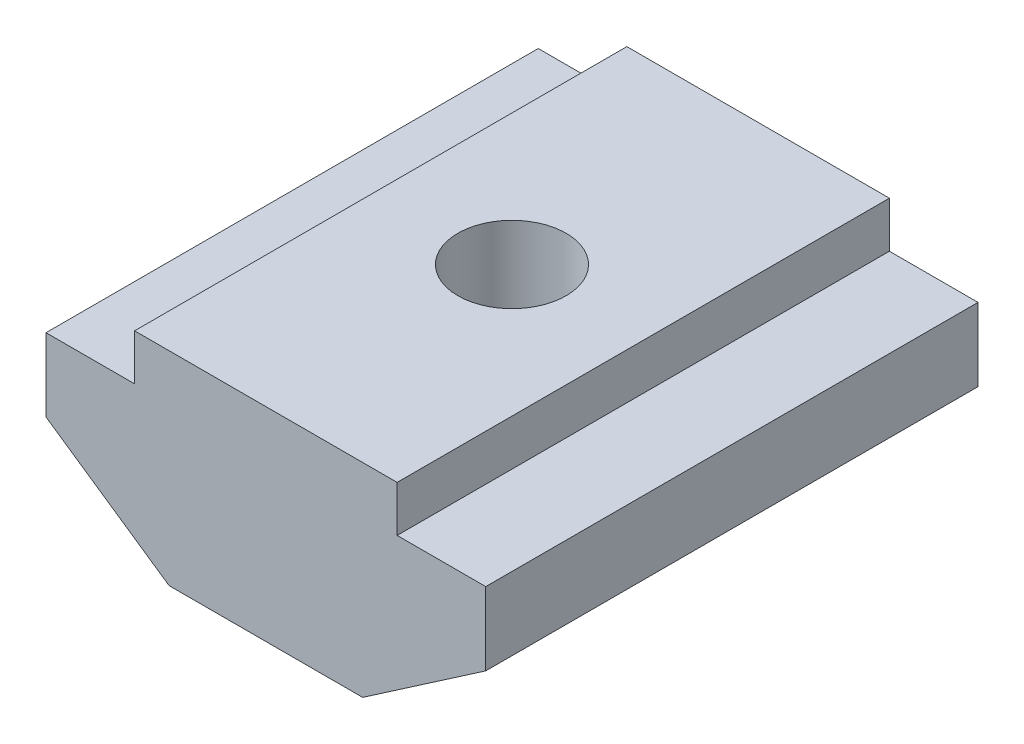
ISO-10303-21;
HEADER;
FILE_DESCRIPTION(('STEP AP214'),'2;1');
FILE_NAME('part.step','',(''),(''),'','','');
FILE_SCHEMA(('AUTOMOTIVE_DESIGN { 1 0 10303 214 1 1 1 1 }'));
ENDSEC;
DATA;
#1=APPLICATION_CONTEXT('core data for automotive mechanical design processes');
#2=APPLICATION_PROTOCOL_DEFINITION('international standard','automotive_design',2000,#1);
#3=PRODUCT_CONTEXT('',#1,'mechanical');
#4=PRODUCT('Part','Part','',(#3));
#5=PRODUCT_RELATED_PRODUCT_CATEGORY('part','',(#4));
#6=PRODUCT_DEFINITION_FORMATION('','',#4);
#7=PRODUCT_DEFINITION_CONTEXT('part definition',#1,'design');
#8=PRODUCT_DEFINITION('design','',#6,#7);
#9=PRODUCT_DEFINITION_SHAPE('','',#8);
#10=(LENGTH_UNIT() NAMED_UNIT(*) SI_UNIT(.MILLI.,.METRE.));
#11=(NAMED_UNIT(*) PLANE_ANGLE_UNIT() SI_UNIT($,.RADIAN.));
#12=(NAMED_UNIT(*) SI_UNIT($,.STERADIAN.) SOLID_ANGLE_UNIT());
#13=UNCERTAINTY_MEASURE_WITH_UNIT(LENGTH_MEASURE(1.E-05),#10,'distance_accuracy_value','');
#14=(GEOMETRIC_REPRESENTATION_CONTEXT(3) GLOBAL_UNCERTAINTY_ASSIGNED_CONTEXT((#13)) GLOBAL_UNIT_ASSIGNED_CONTEXT((#10,
#11,#12)) REPRESENTATION_CONTEXT('',''));
#15=CARTESIAN_POINT('',(0.,0.,0.));
#16=DIRECTION('',(0.,0.,1.));
#17=DIRECTION('',(1.,0.,0.));
#18=AXIS2_PLACEMENT_3D('',#15,#16,#17);
#19=CARTESIAN_POINT('',(-4.,0.,7.5));
#20=DIRECTION('',(1.,0.,0.));
#21=DIRECTION('',(0.,0.,-1.));
#22=AXIS2_PLACEMENT_3D('',#19,#20,#21);
#23=PLANE('',#22);
#24=DIRECTION('',(0.,-1.,0.));
#25=VECTOR('',#24,1.);
#26=CARTESIAN_POINT('',(-4.,0.,-7.5));
#27=LINE('',#26,#25);
#28=CARTESIAN_POINT('',(-4.,0.,-7.5));
#29=VERTEX_POINT('',#28);
#30=CARTESIAN_POINT('',(-4.,-1.4,-7.5));
#31=VERTEX_POINT('',#30);
#32=EDGE_CURVE('E147',#29,#31,#27,.T.);
#33=ORIENTED_EDGE('',*,*,#32,.T.);
#34=DIRECTION('',(0.,0.,-1.));
#35=VECTOR('',#34,1.);
#36=CARTESIAN_POINT('',(-4.,-1.4,7.5));
#37=LINE('',#36,#35);
#38=CARTESIAN_POINT('',(-4.,-1.4,7.5));
#39=VERTEX_POINT('',#38);
#40=EDGE_CURVE('E11',#39,#31,#37,.T.);
#41=ORIENTED_EDGE('',*,*,#40,.F.);
#42=DIRECTION('',(0.,-1.,0.));
#43=VECTOR('',#42,1.);
#44=CARTESIAN_POINT('',(-4.,0.,7.5));
#45=LINE('',#44,#43);
#46=CARTESIAN_POINT('',(-4.,0.,7.5));
#47=VERTEX_POINT('',#46);
#48=EDGE_CURVE('E166',#47,#39,#45,.T.);
#49=ORIENTED_EDGE('',*,*,#48,.F.);
#50=DIRECTION('',(0.,0.,-1.));
#51=VECTOR('',#50,1.);
#52=CARTESIAN_POINT('',(-4.,0.,7.5));
#53=LINE('',#52,#51);
#54=EDGE_CURVE('E143',#47,#29,#53,.T.);
#55=ORIENTED_EDGE('',*,*,#54,.T.);
#56=EDGE_LOOP('',(#33,#41,#49,#55));
#57=FACE_BOUND('',#56,.T.);
#58=ADVANCED_FACE('F39',(#57),#23,.F.);
#59=CARTESIAN_POINT('',(-4.,-1.4,7.5));
#60=DIRECTION('',(0.,-1.,0.));
#61=DIRECTION('',(1.,0.,0.));
#62=AXIS2_PLACEMENT_3D('',#59,#60,#61);
#63=PLANE('',#62);
#64=DIRECTION('',(-1.,0.,0.));
#65=VECTOR('',#64,1.);
#66=CARTESIAN_POINT('',(-4.,-1.4,-7.5));
#67=LINE('',#66,#65);
#68=CARTESIAN_POINT('',(-6.7,-1.4,-7.5));
#69=VERTEX_POINT('',#68);
#70=EDGE_CURVE('E150',#31,#69,#67,.T.);
#71=ORIENTED_EDGE('',*,*,#70,.T.);
#72=DIRECTION('',(0.,0.,-1.));
#73=VECTOR('',#72,1.);
#74=CARTESIAN_POINT('',(-6.7,-1.4,7.5));
#75=LINE('',#74,#73);
#76=CARTESIAN_POINT('',(-6.7,-1.4,7.5));
#77=VERTEX_POINT('',#76);
#78=EDGE_CURVE('E47',#77,#69,#75,.T.);
#79=ORIENTED_EDGE('',*,*,#78,.F.);
#80=DIRECTION('',(-1.,0.,0.));
#81=VECTOR('',#80,1.);
#82=CARTESIAN_POINT('',(-4.,-1.4,7.5));
#83=LINE('',#82,#81);
#84=EDGE_CURVE('E104',#39,#77,#83,.T.);
#85=ORIENTED_EDGE('',*,*,#84,.F.);
#86=ORIENTED_EDGE('',*,*,#40,.T.);
#87=EDGE_LOOP('',(#71,#79,#85,#86));
#88=FACE_BOUND('',#87,.T.);
#89=ADVANCED_FACE('F232',(#88),#63,.F.);
#90=CARTESIAN_POINT('',(-6.7,-1.4,7.5));
#91=DIRECTION('',(1.,0.,0.));
#92=DIRECTION('',(0.,0.,-1.));
#93=AXIS2_PLACEMENT_3D('',#90,#91,#92);
#94=PLANE('',#93);
#95=DIRECTION('',(0.,-1.,0.));
#96=VECTOR('',#95,1.);
#97=CARTESIAN_POINT('',(-6.7,-1.4,-7.5));
#98=LINE('',#97,#96);
#99=CARTESIAN_POINT('',(-6.7,-3.62515365738725,-7.5));
#100=VERTEX_POINT('',#99);
#101=EDGE_CURVE('E153',#69,#100,#98,.T.);
#102=ORIENTED_EDGE('',*,*,#101,.T.);
#103=DIRECTION('',(0.,0.,-1.));
#104=VECTOR('',#103,1.);
#105=CARTESIAN_POINT('',(-6.7,-3.62515365738725,7.5));
#106=LINE('',#105,#104);
#107=CARTESIAN_POINT('',(-6.7,-3.62515365738725,7.5));
#108=VERTEX_POINT('',#107);
#109=EDGE_CURVE('E179',#108,#100,#106,.T.);
#110=ORIENTED_EDGE('',*,*,#109,.F.);
#111=DIRECTION('',(0.,-1.,0.));
#112=VECTOR('',#111,1.);
#113=CARTESIAN_POINT('',(-6.7,-1.4,7.5));
#114=LINE('',#113,#112);
#115=EDGE_CURVE('E187',#77,#108,#114,.T.);
#116=ORIENTED_EDGE('',*,*,#115,.F.);
#117=ORIENTED_EDGE('',*,*,#78,.T.);
#118=EDGE_LOOP('',(#102,#110,#116,#117));
#119=FACE_BOUND('',#118,.T.);
#120=ADVANCED_FACE('F185',(#119),#94,.F.);
#121=CARTESIAN_POINT('',(-6.7,-3.62515365738725,7.5));
#122=DIRECTION('',(0.565895598532683,0.824476907839957,0.));
#123=DIRECTION('',(-0.824476907839957,0.565895598532683,0.));
#124=AXIS2_PLACEMENT_3D('',#121,#122,#123);
#125=PLANE('',#124);
#126=DIRECTION('',(0.824476907839957,-0.565895598532683,0.));
#127=VECTOR('',#126,1.);
#128=CARTESIAN_POINT('',(-6.7,-3.62515365738725,-7.5));
#129=LINE('',#128,#127);
#130=CARTESIAN_POINT('',(-2.94859893551943,-6.2,-7.5));
#131=VERTEX_POINT('',#130);
#132=EDGE_CURVE('E155',#100,#131,#129,.T.);
#133=ORIENTED_EDGE('',*,*,#132,.T.);
#134=DIRECTION('',(0.,0.,-1.));
#135=VECTOR('',#134,1.);
#136=CARTESIAN_POINT('',(-2.94859893551943,-6.2,7.5));
#137=LINE('',#136,#135);
#138=CARTESIAN_POINT('',(-2.94859893551943,-6.2,7.5));
#139=VERTEX_POINT('',#138);
#140=EDGE_CURVE('E176',#139,#131,#137,.T.);
#141=ORIENTED_EDGE('',*,*,#140,.F.);
#142=DIRECTION('',(0.824476907839957,-0.565895598532683,0.));
#143=VECTOR('',#142,1.);
#144=CARTESIAN_POINT('',(-6.7,-3.62515365738725,7.5));
#145=LINE('',#144,#143);
#146=EDGE_CURVE('E205',#108,#139,#145,.T.);
#147=ORIENTED_EDGE('',*,*,#146,.F.);
#148=ORIENTED_EDGE('',*,*,#109,.T.);
#149=EDGE_LOOP('',(#133,#141,#147,#148));
#150=FACE_BOUND('',#149,.T.);
#151=ADVANCED_FACE('F196',(#150),#125,.F.);
#152=CARTESIAN_POINT('',(-2.94859893551943,-6.2,7.5));
#153=DIRECTION('',(0.,1.,0.));
#154=DIRECTION('',(-1.,0.,0.));
#155=AXIS2_PLACEMENT_3D('',#152,#153,#154);
#156=PLANE('',#155);
#157=CARTESIAN_POINT('',(0.,-6.2,0.));
#158=DIRECTION('',(0.,1.,0.));
#159=DIRECTION('',(0.,0.,1.));
#160=AXIS2_PLACEMENT_3D('',#157,#158,#159);
#161=CIRCLE('',#160,1.65);
#162=CARTESIAN_POINT('',(0.,-6.2,1.65));
#163=VERTEX_POINT('',#162);
#164=EDGE_CURVE('E151',#163,#163,#161,.T.);
#165=ORIENTED_EDGE('',*,*,#164,.T.);
#166=EDGE_LOOP('',(#165));
#167=FACE_BOUND('',#166,.T.);
#168=DIRECTION('',(1.,0.,0.));
#169=VECTOR('',#168,1.);
#170=CARTESIAN_POINT('',(-2.94859893551943,-6.2,-7.5));
#171=LINE('',#170,#169);
#172=CARTESIAN_POINT('',(2.94859893551943,-6.2,-7.5));
#173=VERTEX_POINT('',#172);
#174=EDGE_CURVE('E157',#131,#173,#171,.T.);
#175=ORIENTED_EDGE('',*,*,#174,.T.);
#176=DIRECTION('',(0.,0.,-1.));
#177=VECTOR('',#176,1.);
#178=CARTESIAN_POINT('',(2.94859893551943,-6.2,7.5));
#179=LINE('',#178,#177);
#180=CARTESIAN_POINT('',(2.94859893551943,-6.2,7.5));
#181=VERTEX_POINT('',#180);
#182=EDGE_CURVE('E173',#181,#173,#179,.T.);
#183=ORIENTED_EDGE('',*,*,#182,.F.);
#184=DIRECTION('',(1.,0.,0.));
#185=VECTOR('',#184,1.);
#186=CARTESIAN_POINT('',(-2.94859893551943,-6.2,7.5));
#187=LINE('',#186,#185);
#188=EDGE_CURVE('E202',#139,#181,#187,.T.);
#189=ORIENTED_EDGE('',*,*,#188,.F.);
#190=ORIENTED_EDGE('',*,*,#140,.T.);
#191=EDGE_LOOP('',(#175,#183,#189,#190));
#192=FACE_BOUND('',#191,.T.);
#193=ADVANCED_FACE('F200',(#167,#192),#156,.F.);
#194=CARTESIAN_POINT('',(6.7,-3.62515365738725,7.5));
#195=DIRECTION('',(-0.565895598532683,0.824476907839957,0.));
#196=DIRECTION('',(-0.824476907839957,-0.565895598532683,0.));
#197=AXIS2_PLACEMENT_3D('',#194,#195,#196);
#198=PLANE('',#197);
#199=DIRECTION('',(0.824476907839957,0.565895598532683,0.));
#200=VECTOR('',#199,1.);
#201=CARTESIAN_POINT('',(6.7,-3.62515365738725,-7.5));
#202=LINE('',#201,#200);
#203=CARTESIAN_POINT('',(6.7,-3.62515365738725,-7.5));
#204=VERTEX_POINT('',#203);
#205=EDGE_CURVE('E159',#173,#204,#202,.T.);
#206=ORIENTED_EDGE('',*,*,#205,.T.);
#207=DIRECTION('',(0.,0.,-1.));
#208=VECTOR('',#207,1.);
#209=CARTESIAN_POINT('',(6.7,-3.62515365738725,7.5));
#210=LINE('',#209,#208);
#211=CARTESIAN_POINT('',(6.7,-3.62515365738725,7.5));
#212=VERTEX_POINT('',#211);
#213=EDGE_CURVE('E170',#212,#204,#210,.T.);
#214=ORIENTED_EDGE('',*,*,#213,.F.);
#215=DIRECTION('',(0.824476907839957,0.565895598532683,0.));
#216=VECTOR('',#215,1.);
#217=CARTESIAN_POINT('',(6.7,-3.62515365738725,7.5));
#218=LINE('',#217,#216);
#219=EDGE_CURVE('E204',#181,#212,#218,.T.);
#220=ORIENTED_EDGE('',*,*,#219,.F.);
#221=ORIENTED_EDGE('',*,*,#182,.T.);
#222=EDGE_LOOP('',(#206,#214,#220,#221));
#223=FACE_BOUND('',#222,.T.);
#224=ADVANCED_FACE('F244',(#223),#198,.F.);
#225=CARTESIAN_POINT('',(6.7,-1.4,7.5));
#226=DIRECTION('',(-1.,0.,0.));
#227=DIRECTION('',(0.,0.,1.));
#228=AXIS2_PLACEMENT_3D('',#225,#226,#227);
#229=PLANE('',#228);
#230=DIRECTION('',(0.,1.,0.));
#231=VECTOR('',#230,1.);
#232=CARTESIAN_POINT('',(6.7,-1.4,-7.5));
#233=LINE('',#232,#231);
#234=CARTESIAN_POINT('',(6.7,-1.4,-7.5));
#235=VERTEX_POINT('',#234);
#236=EDGE_CURVE('E161',#204,#235,#233,.T.);
#237=ORIENTED_EDGE('',*,*,#236,.T.);
#238=DIRECTION('',(0.,0.,-1.));
#239=VECTOR('',#238,1.);
#240=CARTESIAN_POINT('',(6.7,-1.4,7.5));
#241=LINE('',#240,#239);
#242=CARTESIAN_POINT('',(6.7,-1.4,7.5));
#243=VERTEX_POINT('',#242);
#244=EDGE_CURVE('E138',#243,#235,#241,.T.);
#245=ORIENTED_EDGE('',*,*,#244,.F.);
#246=DIRECTION('',(0.,1.,0.));
#247=VECTOR('',#246,1.);
#248=CARTESIAN_POINT('',(6.7,-1.4,7.5));
#249=LINE('',#248,#247);
#250=EDGE_CURVE('E129',#212,#243,#249,.T.);
#251=ORIENTED_EDGE('',*,*,#250,.F.);
#252=ORIENTED_EDGE('',*,*,#213,.T.);
#253=EDGE_LOOP('',(#237,#245,#251,#252));
#254=FACE_BOUND('',#253,.T.);
#255=ADVANCED_FACE('F241',(#254),#229,.F.);
#256=CARTESIAN_POINT('',(4.,-1.4,7.5));
#257=DIRECTION('',(0.,-1.,0.));
#258=DIRECTION('',(1.,0.,0.));
#259=AXIS2_PLACEMENT_3D('',#256,#257,#258);
#260=PLANE('',#259);
#261=DIRECTION('',(-1.,0.,0.));
#262=VECTOR('',#261,1.);
#263=CARTESIAN_POINT('',(4.,-1.4,-7.5));
#264=LINE('',#263,#262);
#265=CARTESIAN_POINT('',(4.,-1.4,-7.5));
#266=VERTEX_POINT('',#265);
#267=EDGE_CURVE('E137',#235,#266,#264,.T.);
#268=ORIENTED_EDGE('',*,*,#267,.T.);
#269=DIRECTION('',(0.,0.,-1.));
#270=VECTOR('',#269,1.);
#271=CARTESIAN_POINT('',(4.,-1.4,7.5));
#272=LINE('',#271,#270);
#273=CARTESIAN_POINT('',(4.,-1.4,7.5));
#274=VERTEX_POINT('',#273);
#275=EDGE_CURVE('E134',#274,#266,#272,.T.);
#276=ORIENTED_EDGE('',*,*,#275,.F.);
#277=DIRECTION('',(-1.,0.,0.));
#278=VECTOR('',#277,1.);
#279=CARTESIAN_POINT('',(4.,-1.4,7.5));
#280=LINE('',#279,#278);
#281=EDGE_CURVE('E123',#243,#274,#280,.T.);
#282=ORIENTED_EDGE('',*,*,#281,.F.);
#283=ORIENTED_EDGE('',*,*,#244,.T.);
#284=EDGE_LOOP('',(#268,#276,#282,#283));
#285=FACE_BOUND('',#284,.T.);
#286=ADVANCED_FACE('F135',(#285),#260,.F.);
#287=CARTESIAN_POINT('',(4.,0.,7.5));
#288=DIRECTION('',(-1.,0.,0.));
#289=DIRECTION('',(0.,0.,1.));
#290=AXIS2_PLACEMENT_3D('',#287,#288,#289);
#291=PLANE('',#290);
#292=DIRECTION('',(0.,1.,0.));
#293=VECTOR('',#292,1.);
#294=CARTESIAN_POINT('',(4.,0.,-7.5));
#295=LINE('',#294,#293);
#296=CARTESIAN_POINT('',(4.,0.,-7.5));
#297=VERTEX_POINT('',#296);
#298=EDGE_CURVE('E90',#266,#297,#295,.T.);
#299=ORIENTED_EDGE('',*,*,#298,.T.);
#300=DIRECTION('',(0.,0.,-1.));
#301=VECTOR('',#300,1.);
#302=CARTESIAN_POINT('',(4.,0.,7.5));
#303=LINE('',#302,#301);
#304=CARTESIAN_POINT('',(4.,0.,7.5));
#305=VERTEX_POINT('',#304);
#306=EDGE_CURVE('E139',#305,#297,#303,.T.);
#307=ORIENTED_EDGE('',*,*,#306,.F.);
#308=DIRECTION('',(0.,1.,0.));
#309=VECTOR('',#308,1.);
#310=CARTESIAN_POINT('',(4.,0.,7.5));
#311=LINE('',#310,#309);
#312=EDGE_CURVE('E127',#274,#305,#311,.T.);
#313=ORIENTED_EDGE('',*,*,#312,.F.);
#314=ORIENTED_EDGE('',*,*,#275,.T.);
#315=EDGE_LOOP('',(#299,#307,#313,#314));
#316=FACE_BOUND('',#315,.T.);
#317=ADVANCED_FACE('F141',(#316),#291,.F.);
#318=CARTESIAN_POINT('',(4.,0.,7.5));
#319=DIRECTION('',(0.,-1.,0.));
#320=DIRECTION('',(0.,0.,-1.));
#321=AXIS2_PLACEMENT_3D('',#318,#319,#320);
#322=PLANE('',#321);
#323=CARTESIAN_POINT('',(0.,0.,0.));
#324=DIRECTION('',(0.,1.,0.));
#325=DIRECTION('',(0.,0.,1.));
#326=AXIS2_PLACEMENT_3D('',#323,#324,#325);
#327=CIRCLE('',#326,1.64999999999999);
#328=CARTESIAN_POINT('',(0.,0.,1.64999999999999));
#329=VERTEX_POINT('',#328);
#330=EDGE_CURVE('E215',#329,#329,#327,.T.);
#331=ORIENTED_EDGE('',*,*,#330,.F.);
#332=EDGE_LOOP('',(#331));
#333=FACE_BOUND('',#332,.T.);
#334=DIRECTION('',(-1.,0.,0.));
#335=VECTOR('',#334,1.);
#336=CARTESIAN_POINT('',(4.,0.,-7.5));
#337=LINE('',#336,#335);
#338=EDGE_CURVE('E96',#297,#29,#337,.T.);
#339=ORIENTED_EDGE('',*,*,#338,.T.);
#340=ORIENTED_EDGE('',*,*,#54,.F.);
#341=DIRECTION('',(-1.,0.,0.));
#342=VECTOR('',#341,1.);
#343=CARTESIAN_POINT('',(4.,0.,7.5));
#344=LINE('',#343,#342);
#345=EDGE_CURVE('E55',#305,#47,#344,.T.);
#346=ORIENTED_EDGE('',*,*,#345,.F.);
#347=ORIENTED_EDGE('',*,*,#306,.T.);
#348=EDGE_LOOP('',(#339,#340,#346,#347));
#349=FACE_BOUND('',#348,.T.);
#350=ADVANCED_FACE('F221',(#333,#349),#322,.F.);
#351=CARTESIAN_POINT('',(0.,0.,7.5));
#352=DIRECTION('',(0.,0.,-1.));
#353=DIRECTION('',(-1.,0.,0.));
#354=AXIS2_PLACEMENT_3D('',#351,#352,#353);
#355=PLANE('',#354);
#356=ORIENTED_EDGE('',*,*,#48,.T.);
#357=ORIENTED_EDGE('',*,*,#84,.T.);
#358=ORIENTED_EDGE('',*,*,#115,.T.);
#359=ORIENTED_EDGE('',*,*,#146,.T.);
#360=ORIENTED_EDGE('',*,*,#188,.T.);
#361=ORIENTED_EDGE('',*,*,#219,.T.);
#362=ORIENTED_EDGE('',*,*,#250,.T.);
#363=ORIENTED_EDGE('',*,*,#281,.T.);
#364=ORIENTED_EDGE('',*,*,#312,.T.);
#365=ORIENTED_EDGE('',*,*,#345,.T.);
#366=EDGE_LOOP('',(#356,#357,#358,#359,#360,#361,#362,#363,#364,#365));
#367=FACE_BOUND('',#366,.T.);
#368=ADVANCED_FACE('F125',(#367),#355,.F.);
#369=CARTESIAN_POINT('',(0.,0.,-7.5));
#370=DIRECTION('',(0.,0.,-1.));
#371=DIRECTION('',(-1.,0.,0.));
#372=AXIS2_PLACEMENT_3D('',#369,#370,#371);
#373=PLANE('',#372);
#374=ORIENTED_EDGE('',*,*,#32,.F.);
#375=ORIENTED_EDGE('',*,*,#338,.F.);
#376=ORIENTED_EDGE('',*,*,#298,.F.);
#377=ORIENTED_EDGE('',*,*,#267,.F.);
#378=ORIENTED_EDGE('',*,*,#236,.F.);
#379=ORIENTED_EDGE('',*,*,#205,.F.);
#380=ORIENTED_EDGE('',*,*,#174,.F.);
#381=ORIENTED_EDGE('',*,*,#132,.F.);
#382=ORIENTED_EDGE('',*,*,#101,.F.);
#383=ORIENTED_EDGE('',*,*,#70,.F.);
#384=EDGE_LOOP('',(#374,#375,#376,#377,#378,#379,#380,#381,#382,#383));
#385=FACE_BOUND('',#384,.T.);
#386=ADVANCED_FACE('F191',(#385),#373,.T.);
#387=CARTESIAN_POINT('',(0.,0.,0.));
#388=DIRECTION('',(0.,1.,0.));
#389=DIRECTION('',(0.,0.,1.));
#390=AXIS2_PLACEMENT_3D('',#387,#388,#389);
#391=CYLINDRICAL_SURFACE('',#390,1.64999999999999);
#392=ORIENTED_EDGE('',*,*,#164,.F.);
#393=EDGE_LOOP('',(#392));
#394=FACE_BOUND('',#393,.T.);
#395=ORIENTED_EDGE('',*,*,#330,.T.);
#396=EDGE_LOOP('',(#395));
#397=FACE_BOUND('',#396,.T.);
#398=ADVANCED_FACE('F219',(#394,#397),#391,.F.);
#399=CLOSED_SHELL('',(#58,#89,#120,#151,#193,#224,#255,#286,#317,#350,#368,#386,#398));
#400=MANIFOLD_SOLID_BREP('B2',#399);
#401=ADVANCED_BREP_SHAPE_REPRESENTATION('',(#18,#400),#14);
#402=SHAPE_DEFINITION_REPRESENTATION(#9,#401);
ENDSEC;
END-ISO-10303-21;
